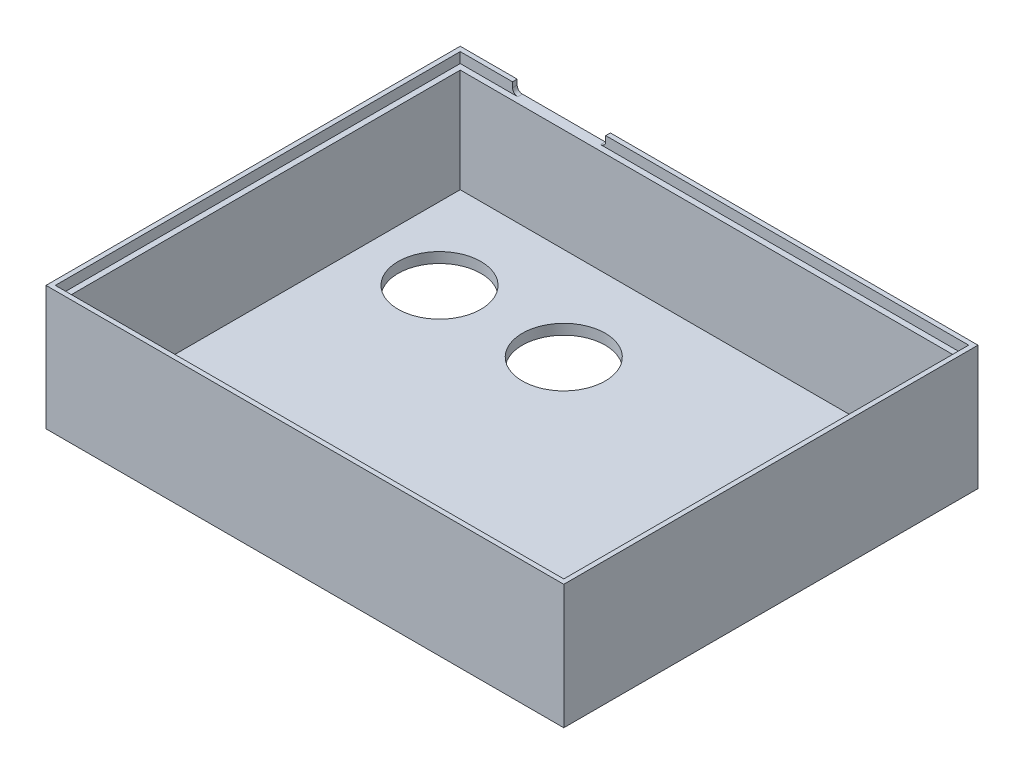
ISO-10303-21;
HEADER;
FILE_DESCRIPTION(('STEP AP214'),'2;1');
FILE_NAME('part.step','',(''),(''),'','','');
FILE_SCHEMA(('AUTOMOTIVE_DESIGN { 1 0 10303 214 1 1 1 1 }'));
ENDSEC;
DATA;
#1=APPLICATION_CONTEXT('core data for automotive mechanical design processes');
#2=APPLICATION_PROTOCOL_DEFINITION('international standard','automotive_design',2000,#1);
#3=PRODUCT_CONTEXT('',#1,'mechanical');
#4=PRODUCT('Part','Part','',(#3));
#5=PRODUCT_RELATED_PRODUCT_CATEGORY('part','',(#4));
#6=PRODUCT_DEFINITION_FORMATION('','',#4);
#7=PRODUCT_DEFINITION_CONTEXT('part definition',#1,'design');
#8=PRODUCT_DEFINITION('design','',#6,#7);
#9=PRODUCT_DEFINITION_SHAPE('','',#8);
#10=(LENGTH_UNIT() NAMED_UNIT(*) SI_UNIT(.MILLI.,.METRE.));
#11=(NAMED_UNIT(*) PLANE_ANGLE_UNIT() SI_UNIT($,.RADIAN.));
#12=(NAMED_UNIT(*) SI_UNIT($,.STERADIAN.) SOLID_ANGLE_UNIT());
#13=UNCERTAINTY_MEASURE_WITH_UNIT(LENGTH_MEASURE(1.E-05),#10,'distance_accuracy_value','');
#14=(GEOMETRIC_REPRESENTATION_CONTEXT(3) GLOBAL_UNCERTAINTY_ASSIGNED_CONTEXT((#13)) GLOBAL_UNIT_ASSIGNED_CONTEXT((#10,
#11,#12)) REPRESENTATION_CONTEXT('',''));
#15=CARTESIAN_POINT('',(0.,0.,0.));
#16=DIRECTION('',(0.,0.,1.));
#17=DIRECTION('',(1.,0.,0.));
#18=AXIS2_PLACEMENT_3D('',#15,#16,#17);
#19=CARTESIAN_POINT('',(49.1,24.,-39.1));
#20=DIRECTION('',(0.,0.,1.));
#21=DIRECTION('',(1.,0.,0.));
#22=AXIS2_PLACEMENT_3D('',#19,#20,#21);
#23=PLANE('',#22);
#24=DIRECTION('',(0.,-1.,0.));
#25=VECTOR('',#24,1.);
#26=CARTESIAN_POINT('',(-39.,24.,-39.1));
#27=LINE('',#26,#25);
#28=CARTESIAN_POINT('',(-39.,24.,-39.1));
#29=VERTEX_POINT('',#28);
#30=CARTESIAN_POINT('',(-39.,23.,-39.1));
#31=VERTEX_POINT('',#30);
#32=EDGE_CURVE('E309',#29,#31,#27,.T.);
#33=ORIENTED_EDGE('',*,*,#32,.F.);
#34=DIRECTION('',(-1.,0.,0.));
#35=VECTOR('',#34,1.);
#36=CARTESIAN_POINT('',(49.1,24.,-39.1));
#37=LINE('',#36,#35);
#38=CARTESIAN_POINT('',(-49.1,24.,-39.1));
#39=VERTEX_POINT('',#38);
#40=EDGE_CURVE('E175',#29,#39,#37,.T.);
#41=ORIENTED_EDGE('',*,*,#40,.T.);
#42=DIRECTION('',(0.,-1.,0.));
#43=VECTOR('',#42,1.);
#44=CARTESIAN_POINT('',(-49.1,24.,-39.1));
#45=LINE('',#44,#43);
#46=CARTESIAN_POINT('',(-49.1,22.,-39.1));
#47=VERTEX_POINT('',#46);
#48=EDGE_CURVE('E343',#39,#47,#45,.T.);
#49=ORIENTED_EDGE('',*,*,#48,.T.);
#50=DIRECTION('',(-1.,0.,0.));
#51=VECTOR('',#50,1.);
#52=CARTESIAN_POINT('',(49.1,22.,-39.1));
#53=LINE('',#52,#51);
#54=CARTESIAN_POINT('',(-38.,22.,-39.1));
#55=VERTEX_POINT('',#54);
#56=EDGE_CURVE('E337',#55,#47,#53,.T.);
#57=ORIENTED_EDGE('',*,*,#56,.F.);
#58=CARTESIAN_POINT('',(-38.,23.,-39.1));
#59=DIRECTION('',(0.,0.,1.));
#60=DIRECTION('',(1.,0.,0.));
#61=AXIS2_PLACEMENT_3D('',#58,#59,#60);
#62=CIRCLE('',#61,1.);
#63=EDGE_CURVE('E11',#55,#31,#62,.F.);
#64=ORIENTED_EDGE('',*,*,#63,.T.);
#65=EDGE_LOOP('',(#33,#41,#49,#57,#64));
#66=FACE_BOUND('',#65,.T.);
#67=ADVANCED_FACE('F35',(#66),#23,.T.);
#68=CARTESIAN_POINT('',(0.,22.,-38.));
#69=DIRECTION('',(0.,0.,1.));
#70=DIRECTION('',(1.,0.,0.));
#71=AXIS2_PLACEMENT_3D('',#68,#69,#70);
#72=PLANE('',#71);
#73=DIRECTION('',(-1.,0.,0.));
#74=VECTOR('',#73,1.);
#75=CARTESIAN_POINT('',(0.,2.,-38.));
#76=LINE('',#75,#74);
#77=CARTESIAN_POINT('',(48.,2.,-38.));
#78=VERTEX_POINT('',#77);
#79=CARTESIAN_POINT('',(-48.,2.,-38.));
#80=VERTEX_POINT('',#79);
#81=EDGE_CURVE('E193',#78,#80,#76,.T.);
#82=ORIENTED_EDGE('',*,*,#81,.F.);
#83=DIRECTION('',(0.,-1.,0.));
#84=VECTOR('',#83,1.);
#85=CARTESIAN_POINT('',(48.,22.,-38.));
#86=LINE('',#85,#84);
#87=CARTESIAN_POINT('',(48.,22.,-38.));
#88=VERTEX_POINT('',#87);
#89=EDGE_CURVE('E223',#88,#78,#86,.T.);
#90=ORIENTED_EDGE('',*,*,#89,.F.);
#91=DIRECTION('',(-1.,0.,0.));
#92=VECTOR('',#91,1.);
#93=CARTESIAN_POINT('',(0.,22.,-38.));
#94=LINE('',#93,#92);
#95=CARTESIAN_POINT('',(-48.,22.,-38.));
#96=VERTEX_POINT('',#95);
#97=EDGE_CURVE('E194',#88,#96,#94,.T.);
#98=ORIENTED_EDGE('',*,*,#97,.T.);
#99=DIRECTION('',(0.,-1.,0.));
#100=VECTOR('',#99,1.);
#101=CARTESIAN_POINT('',(-48.,22.,-38.));
#102=LINE('',#101,#100);
#103=EDGE_CURVE('E206',#96,#80,#102,.T.);
#104=ORIENTED_EDGE('',*,*,#103,.T.);
#105=EDGE_LOOP('',(#82,#90,#98,#104));
#106=FACE_BOUND('',#105,.T.);
#107=ADVANCED_FACE('F277',(#106),#72,.T.);
#108=CARTESIAN_POINT('',(48.,22.,0.));
#109=DIRECTION('',(-1.,0.,0.));
#110=DIRECTION('',(0.,0.,1.));
#111=AXIS2_PLACEMENT_3D('',#108,#109,#110);
#112=PLANE('',#111);
#113=DIRECTION('',(0.,0.,-1.));
#114=VECTOR('',#113,1.);
#115=CARTESIAN_POINT('',(48.,2.,0.));
#116=LINE('',#115,#114);
#117=CARTESIAN_POINT('',(48.,2.,38.));
#118=VERTEX_POINT('',#117);
#119=EDGE_CURVE('E209',#118,#78,#116,.T.);
#120=ORIENTED_EDGE('',*,*,#119,.F.);
#121=DIRECTION('',(0.,-1.,0.));
#122=VECTOR('',#121,1.);
#123=CARTESIAN_POINT('',(48.,22.,38.));
#124=LINE('',#123,#122);
#125=CARTESIAN_POINT('',(48.,22.,38.));
#126=VERTEX_POINT('',#125);
#127=EDGE_CURVE('E221',#126,#118,#124,.T.);
#128=ORIENTED_EDGE('',*,*,#127,.F.);
#129=DIRECTION('',(0.,0.,-1.));
#130=VECTOR('',#129,1.);
#131=CARTESIAN_POINT('',(48.,22.,0.));
#132=LINE('',#131,#130);
#133=EDGE_CURVE('E196',#126,#88,#132,.T.);
#134=ORIENTED_EDGE('',*,*,#133,.T.);
#135=ORIENTED_EDGE('',*,*,#89,.T.);
#136=EDGE_LOOP('',(#120,#128,#134,#135));
#137=FACE_BOUND('',#136,.T.);
#138=ADVANCED_FACE('F283',(#137),#112,.T.);
#139=CARTESIAN_POINT('',(0.,22.,38.));
#140=DIRECTION('',(0.,0.,-1.));
#141=DIRECTION('',(-1.,0.,0.));
#142=AXIS2_PLACEMENT_3D('',#139,#140,#141);
#143=PLANE('',#142);
#144=DIRECTION('',(1.,0.,0.));
#145=VECTOR('',#144,1.);
#146=CARTESIAN_POINT('',(0.,2.,38.));
#147=LINE('',#146,#145);
#148=CARTESIAN_POINT('',(-48.,2.,38.));
#149=VERTEX_POINT('',#148);
#150=EDGE_CURVE('E212',#149,#118,#147,.T.);
#151=ORIENTED_EDGE('',*,*,#150,.F.);
#152=DIRECTION('',(0.,-1.,0.));
#153=VECTOR('',#152,1.);
#154=CARTESIAN_POINT('',(-48.,22.,38.));
#155=LINE('',#154,#153);
#156=CARTESIAN_POINT('',(-48.,22.,38.));
#157=VERTEX_POINT('',#156);
#158=EDGE_CURVE('E218',#157,#149,#155,.T.);
#159=ORIENTED_EDGE('',*,*,#158,.F.);
#160=DIRECTION('',(1.,0.,0.));
#161=VECTOR('',#160,1.);
#162=CARTESIAN_POINT('',(0.,22.,38.));
#163=LINE('',#162,#161);
#164=EDGE_CURVE('E200',#157,#126,#163,.T.);
#165=ORIENTED_EDGE('',*,*,#164,.T.);
#166=ORIENTED_EDGE('',*,*,#127,.T.);
#167=EDGE_LOOP('',(#151,#159,#165,#166));
#168=FACE_BOUND('',#167,.T.);
#169=ADVANCED_FACE('F384',(#168),#143,.T.);
#170=CARTESIAN_POINT('',(-48.,22.,0.));
#171=DIRECTION('',(1.,0.,0.));
#172=DIRECTION('',(0.,0.,-1.));
#173=AXIS2_PLACEMENT_3D('',#170,#171,#172);
#174=PLANE('',#173);
#175=DIRECTION('',(0.,0.,1.));
#176=VECTOR('',#175,1.);
#177=CARTESIAN_POINT('',(-48.,2.,0.));
#178=LINE('',#177,#176);
#179=EDGE_CURVE('E197',#80,#149,#178,.T.);
#180=ORIENTED_EDGE('',*,*,#179,.F.);
#181=ORIENTED_EDGE('',*,*,#103,.F.);
#182=DIRECTION('',(0.,0.,1.));
#183=VECTOR('',#182,1.);
#184=CARTESIAN_POINT('',(-48.,22.,0.));
#185=LINE('',#184,#183);
#186=EDGE_CURVE('E203',#96,#157,#185,.T.);
#187=ORIENTED_EDGE('',*,*,#186,.T.);
#188=ORIENTED_EDGE('',*,*,#158,.T.);
#189=EDGE_LOOP('',(#180,#181,#187,#188));
#190=FACE_BOUND('',#189,.T.);
#191=ADVANCED_FACE('F388',(#190),#174,.T.);
#192=CARTESIAN_POINT('',(0.,22.,0.));
#193=DIRECTION('',(0.,1.,0.));
#194=DIRECTION('',(0.,0.,1.));
#195=AXIS2_PLACEMENT_3D('',#192,#193,#194);
#196=PLANE('',#195);
#197=ORIENTED_EDGE('',*,*,#186,.F.);
#198=ORIENTED_EDGE('',*,*,#97,.F.);
#199=ORIENTED_EDGE('',*,*,#133,.F.);
#200=ORIENTED_EDGE('',*,*,#164,.F.);
#201=EDGE_LOOP('',(#197,#198,#199,#200));
#202=FACE_BOUND('',#201,.T.);
#203=CARTESIAN_POINT('',(49.1,22.,-39.1));
#204=VERTEX_POINT('',#203);
#205=CARTESIAN_POINT('',(-22.,22.,-39.1));
#206=VERTEX_POINT('',#205);
#207=EDGE_CURVE('E338',#204,#206,#53,.T.);
#208=ORIENTED_EDGE('',*,*,#207,.T.);
#209=DIRECTION('',(0.,0.,-1.));
#210=VECTOR('',#209,1.);
#211=CARTESIAN_POINT('',(-22.,22.,0.));
#212=LINE('',#211,#210);
#213=CARTESIAN_POINT('',(-22.,22.,-40.));
#214=VERTEX_POINT('',#213);
#215=EDGE_CURVE('E247',#206,#214,#212,.T.);
#216=ORIENTED_EDGE('',*,*,#215,.T.);
#217=DIRECTION('',(-1.,0.,0.));
#218=VECTOR('',#217,1.);
#219=CARTESIAN_POINT('',(-21.,22.,-40.));
#220=LINE('',#219,#218);
#221=CARTESIAN_POINT('',(-38.,22.,-40.));
#222=VERTEX_POINT('',#221);
#223=EDGE_CURVE('E166',#214,#222,#220,.T.);
#224=ORIENTED_EDGE('',*,*,#223,.T.);
#225=DIRECTION('',(0.,0.,-1.));
#226=VECTOR('',#225,1.);
#227=CARTESIAN_POINT('',(-38.,22.,0.));
#228=LINE('',#227,#226);
#229=EDGE_CURVE('E244',#222,#55,#228,.F.);
#230=ORIENTED_EDGE('',*,*,#229,.T.);
#231=ORIENTED_EDGE('',*,*,#56,.T.);
#232=DIRECTION('',(0.,0.,1.));
#233=VECTOR('',#232,1.);
#234=CARTESIAN_POINT('',(-49.1,22.,-39.1));
#235=LINE('',#234,#233);
#236=CARTESIAN_POINT('',(-49.1,22.,39.1));
#237=VERTEX_POINT('',#236);
#238=EDGE_CURVE('E328',#47,#237,#235,.T.);
#239=ORIENTED_EDGE('',*,*,#238,.T.);
#240=DIRECTION('',(1.,0.,0.));
#241=VECTOR('',#240,1.);
#242=CARTESIAN_POINT('',(-49.1,22.,39.1));
#243=LINE('',#242,#241);
#244=CARTESIAN_POINT('',(49.1,22.,39.1));
#245=VERTEX_POINT('',#244);
#246=EDGE_CURVE('E324',#237,#245,#243,.T.);
#247=ORIENTED_EDGE('',*,*,#246,.T.);
#248=DIRECTION('',(0.,0.,-1.));
#249=VECTOR('',#248,1.);
#250=CARTESIAN_POINT('',(49.1,22.,39.1));
#251=LINE('',#250,#249);
#252=EDGE_CURVE('E335',#245,#204,#251,.T.);
#253=ORIENTED_EDGE('',*,*,#252,.T.);
#254=EDGE_LOOP('',(#208,#216,#224,#230,#231,#239,#247,#253));
#255=FACE_BOUND('',#254,.T.);
#256=ADVANCED_FACE('F260',(#202,#255),#196,.T.);
#257=CARTESIAN_POINT('',(0.,2.,0.));
#258=DIRECTION('',(0.,-1.,0.));
#259=DIRECTION('',(0.,0.,-1.));
#260=AXIS2_PLACEMENT_3D('',#257,#258,#259);
#261=PLANE('',#260);
#262=CARTESIAN_POINT('',(-9.99999999999999,2.,-20.));
#263=DIRECTION('',(0.,-1.,0.));
#264=DIRECTION('',(0.,0.,-1.));
#265=AXIS2_PLACEMENT_3D('',#262,#263,#264);
#266=CIRCLE('',#265,8.);
#267=CARTESIAN_POINT('',(-9.99999999999999,2.,-28.));
#268=VERTEX_POINT('',#267);
#269=EDGE_CURVE('E540',#268,#268,#266,.T.);
#270=ORIENTED_EDGE('',*,*,#269,.T.);
#271=EDGE_LOOP('',(#270));
#272=FACE_BOUND('',#271,.T.);
#273=CARTESIAN_POINT('',(-34.,2.,-20.));
#274=DIRECTION('',(0.,-1.,0.));
#275=DIRECTION('',(0.,0.,-1.));
#276=AXIS2_PLACEMENT_3D('',#273,#274,#275);
#277=CIRCLE('',#276,8.);
#278=CARTESIAN_POINT('',(-34.,2.,-28.));
#279=VERTEX_POINT('',#278);
#280=EDGE_CURVE('E315',#279,#279,#277,.T.);
#281=ORIENTED_EDGE('',*,*,#280,.T.);
#282=EDGE_LOOP('',(#281));
#283=FACE_BOUND('',#282,.T.);
#284=ORIENTED_EDGE('',*,*,#119,.T.);
#285=ORIENTED_EDGE('',*,*,#81,.T.);
#286=ORIENTED_EDGE('',*,*,#179,.T.);
#287=ORIENTED_EDGE('',*,*,#150,.T.);
#288=EDGE_LOOP('',(#284,#285,#286,#287));
#289=FACE_BOUND('',#288,.T.);
#290=ADVANCED_FACE('F378',(#272,#283,#289),#261,.F.);
#291=CARTESIAN_POINT('',(0.,24.,0.));
#292=DIRECTION('',(0.,1.,0.));
#293=DIRECTION('',(0.,0.,1.));
#294=AXIS2_PLACEMENT_3D('',#291,#292,#293);
#295=PLANE('',#294);
#296=DIRECTION('',(0.,0.,-1.));
#297=VECTOR('',#296,1.);
#298=CARTESIAN_POINT('',(-39.,24.,-30.));
#299=LINE('',#298,#297);
#300=CARTESIAN_POINT('',(-39.,24.,-40.));
#301=VERTEX_POINT('',#300);
#302=EDGE_CURVE('E161',#29,#301,#299,.T.);
#303=ORIENTED_EDGE('',*,*,#302,.T.);
#304=DIRECTION('',(-1.,0.,0.));
#305=VECTOR('',#304,1.);
#306=CARTESIAN_POINT('',(50.,24.,-40.));
#307=LINE('',#306,#305);
#308=CARTESIAN_POINT('',(-50.,24.,-40.));
#309=VERTEX_POINT('',#308);
#310=EDGE_CURVE('E172',#301,#309,#307,.T.);
#311=ORIENTED_EDGE('',*,*,#310,.T.);
#312=DIRECTION('',(0.,0.,1.));
#313=VECTOR('',#312,1.);
#314=CARTESIAN_POINT('',(-50.,24.,-40.));
#315=LINE('',#314,#313);
#316=CARTESIAN_POINT('',(-50.,24.,40.));
#317=VERTEX_POINT('',#316);
#318=EDGE_CURVE('E186',#309,#317,#315,.T.);
#319=ORIENTED_EDGE('',*,*,#318,.T.);
#320=DIRECTION('',(1.,0.,0.));
#321=VECTOR('',#320,1.);
#322=CARTESIAN_POINT('',(-50.,24.,40.));
#323=LINE('',#322,#321);
#324=CARTESIAN_POINT('',(50.,24.,40.));
#325=VERTEX_POINT('',#324);
#326=EDGE_CURVE('E188',#317,#325,#323,.T.);
#327=ORIENTED_EDGE('',*,*,#326,.T.);
#328=DIRECTION('',(0.,0.,-1.));
#329=VECTOR('',#328,1.);
#330=CARTESIAN_POINT('',(50.,24.,40.));
#331=LINE('',#330,#329);
#332=CARTESIAN_POINT('',(50.,24.,-40.));
#333=VERTEX_POINT('',#332);
#334=EDGE_CURVE('E183',#325,#333,#331,.T.);
#335=ORIENTED_EDGE('',*,*,#334,.T.);
#336=CARTESIAN_POINT('',(-21.,24.,-40.));
#337=VERTEX_POINT('',#336);
#338=EDGE_CURVE('E182',#333,#337,#307,.T.);
#339=ORIENTED_EDGE('',*,*,#338,.T.);
#340=DIRECTION('',(0.,0.,-1.));
#341=VECTOR('',#340,1.);
#342=CARTESIAN_POINT('',(-21.,24.,-30.));
#343=LINE('',#342,#341);
#344=CARTESIAN_POINT('',(-21.,24.,-39.1));
#345=VERTEX_POINT('',#344);
#346=EDGE_CURVE('E165',#345,#337,#343,.T.);
#347=ORIENTED_EDGE('',*,*,#346,.F.);
#348=CARTESIAN_POINT('',(49.1,24.,-39.1));
#349=VERTEX_POINT('',#348);
#350=EDGE_CURVE('E306',#349,#345,#37,.T.);
#351=ORIENTED_EDGE('',*,*,#350,.F.);
#352=DIRECTION('',(0.,0.,-1.));
#353=VECTOR('',#352,1.);
#354=CARTESIAN_POINT('',(49.1,24.,39.1));
#355=LINE('',#354,#353);
#356=CARTESIAN_POINT('',(49.1,24.,39.1));
#357=VERTEX_POINT('',#356);
#358=EDGE_CURVE('E327',#357,#349,#355,.T.);
#359=ORIENTED_EDGE('',*,*,#358,.F.);
#360=DIRECTION('',(1.,0.,0.));
#361=VECTOR('',#360,1.);
#362=CARTESIAN_POINT('',(-49.1,24.,39.1));
#363=LINE('',#362,#361);
#364=CARTESIAN_POINT('',(-49.1,24.,39.1));
#365=VERTEX_POINT('',#364);
#366=EDGE_CURVE('E325',#365,#357,#363,.T.);
#367=ORIENTED_EDGE('',*,*,#366,.F.);
#368=DIRECTION('',(0.,0.,1.));
#369=VECTOR('',#368,1.);
#370=CARTESIAN_POINT('',(-49.1,24.,-39.1));
#371=LINE('',#370,#369);
#372=EDGE_CURVE('E331',#39,#365,#371,.T.);
#373=ORIENTED_EDGE('',*,*,#372,.F.);
#374=ORIENTED_EDGE('',*,*,#40,.F.);
#375=EDGE_LOOP('',(#303,#311,#319,#327,#335,#339,#347,#351,#359,#367,#373,#374));
#376=FACE_BOUND('',#375,.T.);
#377=ADVANCED_FACE('F170',(#376),#295,.T.);
#378=CARTESIAN_POINT('',(-49.1,24.,39.1));
#379=DIRECTION('',(0.,0.,-1.));
#380=DIRECTION('',(-1.,0.,0.));
#381=AXIS2_PLACEMENT_3D('',#378,#379,#380);
#382=PLANE('',#381);
#383=ORIENTED_EDGE('',*,*,#246,.F.);
#384=DIRECTION('',(0.,-1.,0.));
#385=VECTOR('',#384,1.);
#386=CARTESIAN_POINT('',(-49.1,24.,39.1));
#387=LINE('',#386,#385);
#388=EDGE_CURVE('E333',#365,#237,#387,.T.);
#389=ORIENTED_EDGE('',*,*,#388,.F.);
#390=ORIENTED_EDGE('',*,*,#366,.T.);
#391=DIRECTION('',(0.,-1.,0.));
#392=VECTOR('',#391,1.);
#393=CARTESIAN_POINT('',(49.1,24.,39.1));
#394=LINE('',#393,#392);
#395=EDGE_CURVE('E349',#357,#245,#394,.T.);
#396=ORIENTED_EDGE('',*,*,#395,.T.);
#397=EDGE_LOOP('',(#383,#389,#390,#396));
#398=FACE_BOUND('',#397,.T.);
#399=ADVANCED_FACE('F298',(#398),#382,.T.);
#400=CARTESIAN_POINT('',(49.1,24.,39.1));
#401=DIRECTION('',(-1.,0.,0.));
#402=DIRECTION('',(0.,0.,1.));
#403=AXIS2_PLACEMENT_3D('',#400,#401,#402);
#404=PLANE('',#403);
#405=ORIENTED_EDGE('',*,*,#252,.F.);
#406=ORIENTED_EDGE('',*,*,#395,.F.);
#407=ORIENTED_EDGE('',*,*,#358,.T.);
#408=DIRECTION('',(0.,-1.,0.));
#409=VECTOR('',#408,1.);
#410=CARTESIAN_POINT('',(49.1,24.,-39.1));
#411=LINE('',#410,#409);
#412=EDGE_CURVE('E346',#349,#204,#411,.T.);
#413=ORIENTED_EDGE('',*,*,#412,.T.);
#414=EDGE_LOOP('',(#405,#406,#407,#413));
#415=FACE_BOUND('',#414,.T.);
#416=ADVANCED_FACE('F290',(#415),#404,.T.);
#417=DIRECTION('',(0.,1.,0.));
#418=VECTOR('',#417,1.);
#419=CARTESIAN_POINT('',(-21.,24.,-39.1));
#420=LINE('',#419,#418);
#421=CARTESIAN_POINT('',(-21.,23.,-39.1));
#422=VERTEX_POINT('',#421);
#423=EDGE_CURVE('E176',#422,#345,#420,.T.);
#424=ORIENTED_EDGE('',*,*,#423,.F.);
#425=CARTESIAN_POINT('',(-22.,23.,-39.1));
#426=DIRECTION('',(0.,0.,1.));
#427=DIRECTION('',(1.,0.,0.));
#428=AXIS2_PLACEMENT_3D('',#425,#426,#427);
#429=CIRCLE('',#428,1.);
#430=EDGE_CURVE('E255',#422,#206,#429,.F.);
#431=ORIENTED_EDGE('',*,*,#430,.T.);
#432=ORIENTED_EDGE('',*,*,#207,.F.);
#433=ORIENTED_EDGE('',*,*,#412,.F.);
#434=ORIENTED_EDGE('',*,*,#350,.T.);
#435=EDGE_LOOP('',(#424,#431,#432,#433,#434));
#436=FACE_BOUND('',#435,.T.);
#437=ADVANCED_FACE('F279',(#436),#23,.T.);
#438=CARTESIAN_POINT('',(-49.1,24.,-39.1));
#439=DIRECTION('',(1.,0.,0.));
#440=DIRECTION('',(0.,0.,-1.));
#441=AXIS2_PLACEMENT_3D('',#438,#439,#440);
#442=PLANE('',#441);
#443=ORIENTED_EDGE('',*,*,#238,.F.);
#444=ORIENTED_EDGE('',*,*,#48,.F.);
#445=ORIENTED_EDGE('',*,*,#372,.T.);
#446=ORIENTED_EDGE('',*,*,#388,.T.);
#447=EDGE_LOOP('',(#443,#444,#445,#446));
#448=FACE_BOUND('',#447,.T.);
#449=ADVANCED_FACE('F289',(#448),#442,.T.);
#450=CARTESIAN_POINT('',(0.,0.,0.));
#451=DIRECTION('',(0.,-1.,0.));
#452=DIRECTION('',(0.,0.,-1.));
#453=AXIS2_PLACEMENT_3D('',#450,#451,#452);
#454=PLANE('',#453);
#455=CARTESIAN_POINT('',(-9.99999999999999,0.,-20.));
#456=DIRECTION('',(0.,-1.,0.));
#457=DIRECTION('',(0.,0.,-1.));
#458=AXIS2_PLACEMENT_3D('',#455,#456,#457);
#459=CIRCLE('',#458,8.);
#460=CARTESIAN_POINT('',(-9.99999999999999,0.,-28.));
#461=VERTEX_POINT('',#460);
#462=EDGE_CURVE('E537',#461,#461,#459,.T.);
#463=ORIENTED_EDGE('',*,*,#462,.F.);
#464=EDGE_LOOP('',(#463));
#465=FACE_BOUND('',#464,.T.);
#466=CARTESIAN_POINT('',(-34.,0.,-20.));
#467=DIRECTION('',(0.,-1.,0.));
#468=DIRECTION('',(0.,0.,-1.));
#469=AXIS2_PLACEMENT_3D('',#466,#467,#468);
#470=CIRCLE('',#469,8.);
#471=CARTESIAN_POINT('',(-34.,0.,-28.));
#472=VERTEX_POINT('',#471);
#473=EDGE_CURVE('E318',#472,#472,#470,.T.);
#474=ORIENTED_EDGE('',*,*,#473,.F.);
#475=EDGE_LOOP('',(#474));
#476=FACE_BOUND('',#475,.T.);
#477=DIRECTION('',(0.,0.,1.));
#478=VECTOR('',#477,1.);
#479=CARTESIAN_POINT('',(-50.,0.,-40.));
#480=LINE('',#479,#478);
#481=CARTESIAN_POINT('',(-50.,0.,-40.));
#482=VERTEX_POINT('',#481);
#483=CARTESIAN_POINT('',(-50.,0.,40.));
#484=VERTEX_POINT('',#483);
#485=EDGE_CURVE('E225',#482,#484,#480,.T.);
#486=ORIENTED_EDGE('',*,*,#485,.F.);
#487=DIRECTION('',(-1.,0.,0.));
#488=VECTOR('',#487,1.);
#489=CARTESIAN_POINT('',(50.,0.,-40.));
#490=LINE('',#489,#488);
#491=CARTESIAN_POINT('',(50.,0.,-40.));
#492=VERTEX_POINT('',#491);
#493=EDGE_CURVE('E232',#492,#482,#490,.T.);
#494=ORIENTED_EDGE('',*,*,#493,.F.);
#495=DIRECTION('',(0.,0.,-1.));
#496=VECTOR('',#495,1.);
#497=CARTESIAN_POINT('',(50.,0.,-40.));
#498=LINE('',#497,#496);
#499=CARTESIAN_POINT('',(50.,0.,40.));
#500=VERTEX_POINT('',#499);
#501=EDGE_CURVE('E230',#500,#492,#498,.T.);
#502=ORIENTED_EDGE('',*,*,#501,.F.);
#503=DIRECTION('',(1.,0.,0.));
#504=VECTOR('',#503,1.);
#505=CARTESIAN_POINT('',(50.,0.,40.));
#506=LINE('',#505,#504);
#507=EDGE_CURVE('E228',#484,#500,#506,.T.);
#508=ORIENTED_EDGE('',*,*,#507,.F.);
#509=EDGE_LOOP('',(#486,#494,#502,#508));
#510=FACE_BOUND('',#509,.T.);
#511=ADVANCED_FACE('F296',(#465,#476,#510),#454,.T.);
#512=CARTESIAN_POINT('',(-50.,2.,-40.));
#513=DIRECTION('',(1.,0.,0.));
#514=DIRECTION('',(0.,0.,-1.));
#515=AXIS2_PLACEMENT_3D('',#512,#513,#514);
#516=PLANE('',#515);
#517=ORIENTED_EDGE('',*,*,#485,.T.);
#518=DIRECTION('',(0.,-1.,0.));
#519=VECTOR('',#518,1.);
#520=CARTESIAN_POINT('',(-50.,2.,40.));
#521=LINE('',#520,#519);
#522=EDGE_CURVE('E241',#317,#484,#521,.T.);
#523=ORIENTED_EDGE('',*,*,#522,.F.);
#524=ORIENTED_EDGE('',*,*,#318,.F.);
#525=DIRECTION('',(0.,-1.,0.));
#526=VECTOR('',#525,1.);
#527=CARTESIAN_POINT('',(-50.,2.,-40.));
#528=LINE('',#527,#526);
#529=EDGE_CURVE('E180',#309,#482,#528,.T.);
#530=ORIENTED_EDGE('',*,*,#529,.T.);
#531=EDGE_LOOP('',(#517,#523,#524,#530));
#532=FACE_BOUND('',#531,.T.);
#533=ADVANCED_FACE('F363',(#532),#516,.F.);
#534=CARTESIAN_POINT('',(50.,2.,-40.));
#535=DIRECTION('',(0.,0.,1.));
#536=DIRECTION('',(1.,0.,0.));
#537=AXIS2_PLACEMENT_3D('',#534,#535,#536);
#538=PLANE('',#537);
#539=ORIENTED_EDGE('',*,*,#310,.F.);
#540=DIRECTION('',(0.,1.,0.));
#541=VECTOR('',#540,1.);
#542=CARTESIAN_POINT('',(-39.,22.,-40.));
#543=LINE('',#542,#541);
#544=CARTESIAN_POINT('',(-39.,23.,-40.));
#545=VERTEX_POINT('',#544);
#546=EDGE_CURVE('E158',#545,#301,#543,.T.);
#547=ORIENTED_EDGE('',*,*,#546,.F.);
#548=CARTESIAN_POINT('',(-38.,23.,-40.));
#549=DIRECTION('',(0.,0.,1.));
#550=DIRECTION('',(1.,0.,0.));
#551=AXIS2_PLACEMENT_3D('',#548,#549,#550);
#552=CIRCLE('',#551,1.);
#553=EDGE_CURVE('E43',#545,#222,#552,.T.);
#554=ORIENTED_EDGE('',*,*,#553,.T.);
#555=ORIENTED_EDGE('',*,*,#223,.F.);
#556=CARTESIAN_POINT('',(-22.,23.,-40.));
#557=DIRECTION('',(0.,0.,1.));
#558=DIRECTION('',(1.,0.,0.));
#559=AXIS2_PLACEMENT_3D('',#556,#557,#558);
#560=CIRCLE('',#559,1.);
#561=CARTESIAN_POINT('',(-21.,23.,-40.));
#562=VERTEX_POINT('',#561);
#563=EDGE_CURVE('E253',#214,#562,#560,.T.);
#564=ORIENTED_EDGE('',*,*,#563,.T.);
#565=DIRECTION('',(0.,-1.,0.));
#566=VECTOR('',#565,1.);
#567=CARTESIAN_POINT('',(-21.,24.,-40.));
#568=LINE('',#567,#566);
#569=EDGE_CURVE('E262',#337,#562,#568,.T.);
#570=ORIENTED_EDGE('',*,*,#569,.F.);
#571=ORIENTED_EDGE('',*,*,#338,.F.);
#572=DIRECTION('',(0.,-1.,0.));
#573=VECTOR('',#572,1.);
#574=CARTESIAN_POINT('',(50.,2.,-40.));
#575=LINE('',#574,#573);
#576=EDGE_CURVE('E235',#333,#492,#575,.T.);
#577=ORIENTED_EDGE('',*,*,#576,.T.);
#578=ORIENTED_EDGE('',*,*,#493,.T.);
#579=ORIENTED_EDGE('',*,*,#529,.F.);
#580=EDGE_LOOP('',(#539,#547,#554,#555,#564,#570,#571,#577,#578,#579));
#581=FACE_BOUND('',#580,.T.);
#582=ADVANCED_FACE('F178',(#581),#538,.F.);
#583=CARTESIAN_POINT('',(50.,2.,-40.));
#584=DIRECTION('',(-1.,0.,0.));
#585=DIRECTION('',(0.,0.,1.));
#586=AXIS2_PLACEMENT_3D('',#583,#584,#585);
#587=PLANE('',#586);
#588=ORIENTED_EDGE('',*,*,#501,.T.);
#589=ORIENTED_EDGE('',*,*,#576,.F.);
#590=ORIENTED_EDGE('',*,*,#334,.F.);
#591=DIRECTION('',(0.,-1.,0.));
#592=VECTOR('',#591,1.);
#593=CARTESIAN_POINT('',(50.,2.,40.));
#594=LINE('',#593,#592);
#595=EDGE_CURVE('E238',#325,#500,#594,.T.);
#596=ORIENTED_EDGE('',*,*,#595,.T.);
#597=EDGE_LOOP('',(#588,#589,#590,#596));
#598=FACE_BOUND('',#597,.T.);
#599=ADVANCED_FACE('F358',(#598),#587,.F.);
#600=CARTESIAN_POINT('',(50.,2.,40.));
#601=DIRECTION('',(0.,0.,-1.));
#602=DIRECTION('',(-1.,0.,0.));
#603=AXIS2_PLACEMENT_3D('',#600,#601,#602);
#604=PLANE('',#603);
#605=ORIENTED_EDGE('',*,*,#507,.T.);
#606=ORIENTED_EDGE('',*,*,#595,.F.);
#607=ORIENTED_EDGE('',*,*,#326,.F.);
#608=ORIENTED_EDGE('',*,*,#522,.T.);
#609=EDGE_LOOP('',(#605,#606,#607,#608));
#610=FACE_BOUND('',#609,.T.);
#611=ADVANCED_FACE('F355',(#610),#604,.F.);
#612=CARTESIAN_POINT('',(-39.,22.,-30.));
#613=DIRECTION('',(-1.,0.,0.));
#614=DIRECTION('',(0.,0.,1.));
#615=AXIS2_PLACEMENT_3D('',#612,#613,#614);
#616=PLANE('',#615);
#617=ORIENTED_EDGE('',*,*,#32,.T.);
#618=DIRECTION('',(0.,0.,-1.));
#619=VECTOR('',#618,1.);
#620=CARTESIAN_POINT('',(-39.,23.,-30.));
#621=LINE('',#620,#619);
#622=EDGE_CURVE('E162',#31,#545,#621,.T.);
#623=ORIENTED_EDGE('',*,*,#622,.T.);
#624=ORIENTED_EDGE('',*,*,#546,.T.);
#625=ORIENTED_EDGE('',*,*,#302,.F.);
#626=EDGE_LOOP('',(#617,#623,#624,#625));
#627=FACE_BOUND('',#626,.T.);
#628=ADVANCED_FACE('F160',(#627),#616,.F.);
#629=CARTESIAN_POINT('',(-21.,24.,-30.));
#630=DIRECTION('',(1.,0.,0.));
#631=DIRECTION('',(0.,0.,-1.));
#632=AXIS2_PLACEMENT_3D('',#629,#630,#631);
#633=PLANE('',#632);
#634=ORIENTED_EDGE('',*,*,#569,.T.);
#635=DIRECTION('',(0.,0.,-1.));
#636=VECTOR('',#635,1.);
#637=CARTESIAN_POINT('',(-21.,23.,-30.));
#638=LINE('',#637,#636);
#639=EDGE_CURVE('E250',#562,#422,#638,.F.);
#640=ORIENTED_EDGE('',*,*,#639,.T.);
#641=ORIENTED_EDGE('',*,*,#423,.T.);
#642=ORIENTED_EDGE('',*,*,#346,.T.);
#643=EDGE_LOOP('',(#634,#640,#641,#642));
#644=FACE_BOUND('',#643,.T.);
#645=ADVANCED_FACE('F274',(#644),#633,.F.);
#646=CARTESIAN_POINT('',(-22.,23.,0.));
#647=DIRECTION('',(0.,0.,-1.));
#648=DIRECTION('',(-1.,0.,0.));
#649=AXIS2_PLACEMENT_3D('',#646,#647,#648);
#650=CYLINDRICAL_SURFACE('',#649,1.);
#651=ORIENTED_EDGE('',*,*,#430,.F.);
#652=ORIENTED_EDGE('',*,*,#639,.F.);
#653=ORIENTED_EDGE('',*,*,#563,.F.);
#654=ORIENTED_EDGE('',*,*,#215,.F.);
#655=EDGE_LOOP('',(#651,#652,#653,#654));
#656=FACE_BOUND('',#655,.T.);
#657=ADVANCED_FACE('F266',(#656),#650,.F.);
#658=CARTESIAN_POINT('',(-38.,23.,-30.));
#659=DIRECTION('',(0.,0.,-1.));
#660=DIRECTION('',(-1.,0.,0.));
#661=AXIS2_PLACEMENT_3D('',#658,#659,#660);
#662=CYLINDRICAL_SURFACE('',#661,1.);
#663=ORIENTED_EDGE('',*,*,#63,.F.);
#664=ORIENTED_EDGE('',*,*,#229,.F.);
#665=ORIENTED_EDGE('',*,*,#553,.F.);
#666=ORIENTED_EDGE('',*,*,#622,.F.);
#667=EDGE_LOOP('',(#663,#664,#665,#666));
#668=FACE_BOUND('',#667,.T.);
#669=ADVANCED_FACE('F37',(#668),#662,.F.);
#670=CARTESIAN_POINT('',(-34.,10.,-20.));
#671=DIRECTION('',(0.,-1.,0.));
#672=DIRECTION('',(0.,0.,-1.));
#673=AXIS2_PLACEMENT_3D('',#670,#671,#672);
#674=CYLINDRICAL_SURFACE('',#673,8.);
#675=ORIENTED_EDGE('',*,*,#473,.T.);
#676=EDGE_LOOP('',(#675));
#677=FACE_BOUND('',#676,.T.);
#678=ORIENTED_EDGE('',*,*,#280,.F.);
#679=EDGE_LOOP('',(#678));
#680=FACE_BOUND('',#679,.T.);
#681=ADVANCED_FACE('F265',(#677,#680),#674,.F.);
#682=CARTESIAN_POINT('',(-9.99999999999999,10.,-20.));
#683=DIRECTION('',(0.,-1.,0.));
#684=DIRECTION('',(0.,0.,-1.));
#685=AXIS2_PLACEMENT_3D('',#682,#683,#684);
#686=CYLINDRICAL_SURFACE('',#685,8.);
#687=ORIENTED_EDGE('',*,*,#462,.T.);
#688=EDGE_LOOP('',(#687));
#689=FACE_BOUND('',#688,.T.);
#690=ORIENTED_EDGE('',*,*,#269,.F.);
#691=EDGE_LOOP('',(#690));
#692=FACE_BOUND('',#691,.T.);
#693=ADVANCED_FACE('F271',(#689,#692),#686,.F.);
#694=CLOSED_SHELL('',(#67,#107,#138,#169,#191,#256,#290,#377,#399,#416,#437,#449,#511,#533,#582,
#599,#611,#628,#645,#657,#669,#681,#693));
#695=MANIFOLD_SOLID_BREP('B2',#694);
#696=ADVANCED_BREP_SHAPE_REPRESENTATION('',(#18,#695),#14);
#697=SHAPE_DEFINITION_REPRESENTATION(#9,#696);
ENDSEC;
END-ISO-10303-21;
